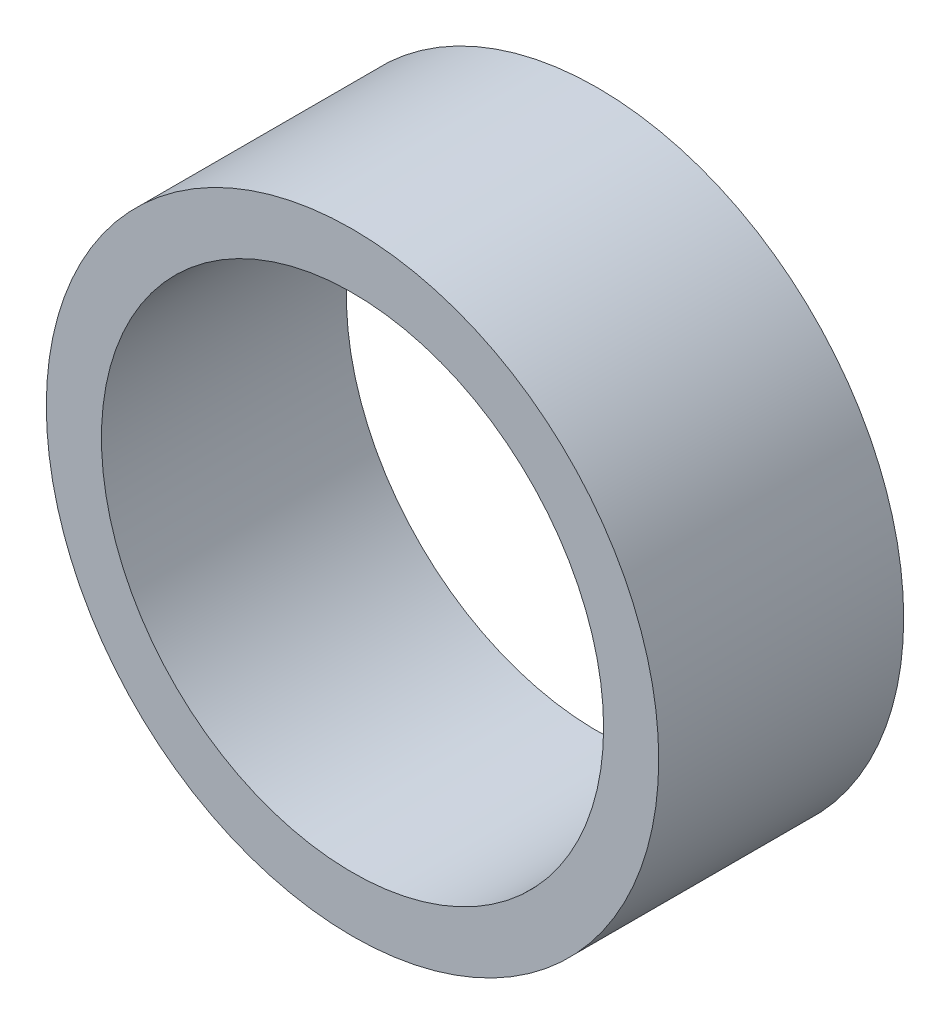
ISO-10303-21;
HEADER;
FILE_DESCRIPTION(('STEP AP214'),'2;1');
FILE_NAME('part.step','',(''),(''),'','','');
FILE_SCHEMA(('AUTOMOTIVE_DESIGN { 1 0 10303 214 1 1 1 1 }'));
ENDSEC;
DATA;
#1=APPLICATION_CONTEXT('core data for automotive mechanical design processes');
#2=APPLICATION_PROTOCOL_DEFINITION('international standard','automotive_design',2000,#1);
#3=PRODUCT_CONTEXT('',#1,'mechanical');
#4=PRODUCT('Part','Part','',(#3));
#5=PRODUCT_RELATED_PRODUCT_CATEGORY('part','',(#4));
#6=PRODUCT_DEFINITION_FORMATION('','',#4);
#7=PRODUCT_DEFINITION_CONTEXT('part definition',#1,'design');
#8=PRODUCT_DEFINITION('design','',#6,#7);
#9=PRODUCT_DEFINITION_SHAPE('','',#8);
#10=(LENGTH_UNIT() NAMED_UNIT(*) SI_UNIT(.MILLI.,.METRE.));
#11=(NAMED_UNIT(*) PLANE_ANGLE_UNIT() SI_UNIT($,.RADIAN.));
#12=(NAMED_UNIT(*) SI_UNIT($,.STERADIAN.) SOLID_ANGLE_UNIT());
#13=UNCERTAINTY_MEASURE_WITH_UNIT(LENGTH_MEASURE(1.E-05),#10,'distance_accuracy_value','');
#14=(GEOMETRIC_REPRESENTATION_CONTEXT(3) GLOBAL_UNCERTAINTY_ASSIGNED_CONTEXT((#13)) GLOBAL_UNIT_ASSIGNED_CONTEXT((#10,
#11,#12)) REPRESENTATION_CONTEXT('',''));
#15=CARTESIAN_POINT('',(0.,0.,0.));
#16=DIRECTION('',(0.,0.,1.));
#17=DIRECTION('',(1.,0.,0.));
#18=AXIS2_PLACEMENT_3D('',#15,#16,#17);
#19=CARTESIAN_POINT('',(-86.9476413760217,24.6003434705315,20.));
#20=DIRECTION('',(0.,0.,1.));
#21=DIRECTION('',(1.,0.,0.));
#22=AXIS2_PLACEMENT_3D('',#19,#20,#21);
#23=PLANE('',#22);
#24=CARTESIAN_POINT('',(-86.9476413760217,24.6003434705315,20.));
#25=DIRECTION('',(0.,0.,1.));
#26=DIRECTION('',(1.,0.,0.));
#27=AXIS2_PLACEMENT_3D('',#24,#25,#26);
#28=CIRCLE('',#27,25.);
#29=CARTESIAN_POINT('',(-61.9476413760217,24.6003434705315,20.));
#30=VERTEX_POINT('',#29);
#31=EDGE_CURVE('E10',#30,#30,#28,.T.);
#32=ORIENTED_EDGE('',*,*,#31,.T.);
#33=EDGE_LOOP('',(#32));
#34=FACE_BOUND('',#33,.T.);
#35=CARTESIAN_POINT('',(-86.9476413760217,24.6003434705315,20.));
#36=DIRECTION('',(0.,0.,1.));
#37=DIRECTION('',(1.,0.,0.));
#38=AXIS2_PLACEMENT_3D('',#35,#36,#37);
#39=CIRCLE('',#38,20.5);
#40=CARTESIAN_POINT('',(-66.4476413760217,24.6003434705315,20.));
#41=VERTEX_POINT('',#40);
#42=EDGE_CURVE('E43',#41,#41,#39,.T.);
#43=ORIENTED_EDGE('',*,*,#42,.F.);
#44=EDGE_LOOP('',(#43));
#45=FACE_BOUND('',#44,.T.);
#46=ADVANCED_FACE('F32',(#34,#45),#23,.T.);
#47=CARTESIAN_POINT('',(-86.9476413760217,24.6003434705315,0.));
#48=DIRECTION('',(0.,0.,1.));
#49=DIRECTION('',(1.,0.,0.));
#50=AXIS2_PLACEMENT_3D('',#47,#48,#49);
#51=PLANE('',#50);
#52=CARTESIAN_POINT('',(-86.9476413760217,24.6003434705315,0.));
#53=DIRECTION('',(0.,0.,1.));
#54=DIRECTION('',(1.,0.,0.));
#55=AXIS2_PLACEMENT_3D('',#52,#53,#54);
#56=CIRCLE('',#55,25.);
#57=CARTESIAN_POINT('',(-61.9476413760217,24.6003434705315,0.));
#58=VERTEX_POINT('',#57);
#59=EDGE_CURVE('E36',#58,#58,#56,.T.);
#60=ORIENTED_EDGE('',*,*,#59,.F.);
#61=EDGE_LOOP('',(#60));
#62=FACE_BOUND('',#61,.T.);
#63=CARTESIAN_POINT('',(-86.9476413760217,24.6003434705315,0.));
#64=DIRECTION('',(0.,0.,1.));
#65=DIRECTION('',(1.,0.,0.));
#66=AXIS2_PLACEMENT_3D('',#63,#64,#65);
#67=CIRCLE('',#66,20.5);
#68=CARTESIAN_POINT('',(-66.4476413760217,24.6003434705315,0.));
#69=VERTEX_POINT('',#68);
#70=EDGE_CURVE('E45',#69,#69,#67,.T.);
#71=ORIENTED_EDGE('',*,*,#70,.T.);
#72=EDGE_LOOP('',(#71));
#73=FACE_BOUND('',#72,.T.);
#74=ADVANCED_FACE('F55',(#62,#73),#51,.F.);
#75=CARTESIAN_POINT('',(-86.9476413760217,24.6003434705315,20.));
#76=DIRECTION('',(0.,0.,-1.));
#77=DIRECTION('',(-1.,0.,0.));
#78=AXIS2_PLACEMENT_3D('',#75,#76,#77);
#79=CYLINDRICAL_SURFACE('',#78,25.);
#80=ORIENTED_EDGE('',*,*,#31,.F.);
#81=EDGE_LOOP('',(#80));
#82=FACE_BOUND('',#81,.T.);
#83=ORIENTED_EDGE('',*,*,#59,.T.);
#84=EDGE_LOOP('',(#83));
#85=FACE_BOUND('',#84,.T.);
#86=ADVANCED_FACE('F34',(#82,#85),#79,.T.);
#87=CARTESIAN_POINT('',(-86.9476413760217,24.6003434705315,20.));
#88=DIRECTION('',(0.,0.,-1.));
#89=DIRECTION('',(-1.,0.,0.));
#90=AXIS2_PLACEMENT_3D('',#87,#88,#89);
#91=CYLINDRICAL_SURFACE('',#90,20.5);
#92=ORIENTED_EDGE('',*,*,#42,.T.);
#93=EDGE_LOOP('',(#92));
#94=FACE_BOUND('',#93,.T.);
#95=ORIENTED_EDGE('',*,*,#70,.F.);
#96=EDGE_LOOP('',(#95));
#97=FACE_BOUND('',#96,.T.);
#98=ADVANCED_FACE('F51',(#94,#97),#91,.F.);
#99=CLOSED_SHELL('',(#46,#74,#86,#98));
#100=MANIFOLD_SOLID_BREP('B2',#99);
#101=ADVANCED_BREP_SHAPE_REPRESENTATION('',(#18,#100),#14);
#102=SHAPE_DEFINITION_REPRESENTATION(#9,#101);
ENDSEC;
END-ISO-10303-21;
